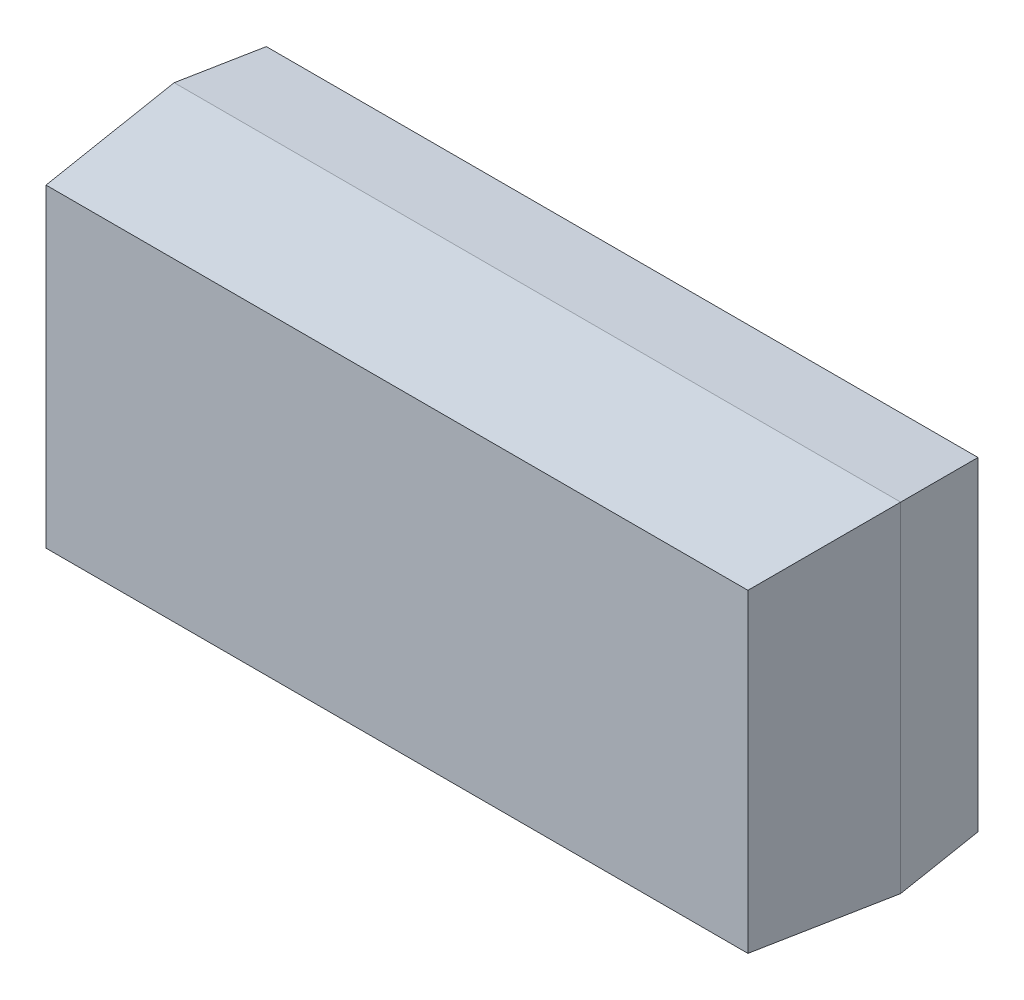
ISO-10303-21;
HEADER;
FILE_DESCRIPTION(('STEP AP214'),'2;1');
FILE_NAME('part.step','',(''),(''),'','','');
FILE_SCHEMA(('AUTOMOTIVE_DESIGN { 1 0 10303 214 1 1 1 1 }'));
ENDSEC;
DATA;
#1=APPLICATION_CONTEXT('core data for automotive mechanical design processes');
#2=APPLICATION_PROTOCOL_DEFINITION('international standard','automotive_design',2000,#1);
#3=PRODUCT_CONTEXT('',#1,'mechanical');
#4=PRODUCT('Part','Part','',(#3));
#5=PRODUCT_RELATED_PRODUCT_CATEGORY('part','',(#4));
#6=PRODUCT_DEFINITION_FORMATION('','',#4);
#7=PRODUCT_DEFINITION_CONTEXT('part definition',#1,'design');
#8=PRODUCT_DEFINITION('design','',#6,#7);
#9=PRODUCT_DEFINITION_SHAPE('','',#8);
#10=(LENGTH_UNIT() NAMED_UNIT(*) SI_UNIT(.MILLI.,.METRE.));
#11=(NAMED_UNIT(*) PLANE_ANGLE_UNIT() SI_UNIT($,.RADIAN.));
#12=(NAMED_UNIT(*) SI_UNIT($,.STERADIAN.) SOLID_ANGLE_UNIT());
#13=UNCERTAINTY_MEASURE_WITH_UNIT(LENGTH_MEASURE(1.E-05),#10,'distance_accuracy_value','');
#14=(GEOMETRIC_REPRESENTATION_CONTEXT(3) GLOBAL_UNCERTAINTY_ASSIGNED_CONTEXT((#13)) GLOBAL_UNIT_ASSIGNED_CONTEXT((#10,
#11,#12)) REPRESENTATION_CONTEXT('',''));
#15=CARTESIAN_POINT('',(0.,0.,0.));
#16=DIRECTION('',(0.,0.,1.));
#17=DIRECTION('',(1.,0.,0.));
#18=AXIS2_PLACEMENT_3D('',#15,#16,#17);
#19=CARTESIAN_POINT('',(0.769320879268443,-0.477296875218552,0.109475868077966));
#20=DIRECTION('',(0.,0.,-1.));
#21=DIRECTION('',(0.,1.,0.));
#22=AXIS2_PLACEMENT_3D('',#19,#20,#21);
#23=PLANE('',#22);
#24=DIRECTION('',(0.,1.,0.));
#25=VECTOR('',#24,1.);
#26=CARTESIAN_POINT('',(0.889141304773381,-0.418864503853573,0.109475868077966));
#27=LINE('',#26,#25);
#28=CARTESIAN_POINT('',(0.889141304773381,-0.47474074696991,0.109475868077966));
#29=VERTEX_POINT('',#28);
#30=CARTESIAN_POINT('',(0.889141304773381,-0.423618181997077,0.109475868077966));
#31=VERTEX_POINT('',#30);
#32=EDGE_CURVE('E89',#29,#31,#27,.T.);
#33=ORIENTED_EDGE('',*,*,#32,.T.);
#34=DIRECTION('',(1.,0.,0.));
#35=VECTOR('',#34,1.);
#36=CARTESIAN_POINT('',(0.767123329373579,-0.423618181997076,0.109475868077966));
#37=LINE('',#36,#35);
#38=CARTESIAN_POINT('',(0.775026613816297,-0.423618181997077,0.109475868077966));
#39=VERTEX_POINT('',#38);
#40=EDGE_CURVE('E71',#31,#39,#37,.F.);
#41=ORIENTED_EDGE('',*,*,#40,.T.);
#42=DIRECTION('',(0.,1.,0.));
#43=VECTOR('',#42,1.);
#44=CARTESIAN_POINT('',(0.775026613816297,-0.418864503853572,0.109475868077966));
#45=LINE('',#44,#43);
#46=CARTESIAN_POINT('',(0.775026613816297,-0.47474074696991,0.109475868077966));
#47=VERTEX_POINT('',#46);
#48=EDGE_CURVE('E20',#39,#47,#45,.F.);
#49=ORIENTED_EDGE('',*,*,#48,.T.);
#50=DIRECTION('',(1.,0.,0.));
#51=VECTOR('',#50,1.);
#52=CARTESIAN_POINT('',(0.767123329373579,-0.47474074696991,0.109475868077966));
#53=LINE('',#52,#51);
#54=EDGE_CURVE('E67',#47,#29,#53,.T.);
#55=ORIENTED_EDGE('',*,*,#54,.T.);
#56=EDGE_LOOP('',(#33,#41,#49,#55));
#57=FACE_BOUND('',#56,.T.);
#58=ADVANCED_FACE('F17',(#57),#23,.F.);
#59=CARTESIAN_POINT('',(0.772928952553018,-0.418864503853572,0.0854994901252098));
#60=DIRECTION('',(0.996194698091746,0.,-0.0871557427476491));
#61=DIRECTION('',(-0.0871557427476491,0.,-0.996194698091746));
#62=AXIS2_PLACEMENT_3D('',#59,#60,#61);
#63=PLANE('',#62);
#64=DIRECTION('',(0.0868265938642312,0.0868265938642406,0.992432509138969));
#65=VECTOR('',#64,1.);
#66=CARTESIAN_POINT('',(0.773028841184603,-0.476738519601604,0.0866412224086743));
#67=LINE('',#66,#65);
#68=CARTESIAN_POINT('',(0.773028841184603,-0.476738519601604,0.0866412224086743));
#69=VERTEX_POINT('',#68);
#70=EDGE_CURVE('E76',#69,#47,#67,.T.);
#71=ORIENTED_EDGE('',*,*,#70,.T.);
#72=ORIENTED_EDGE('',*,*,#48,.F.);
#73=DIRECTION('',(-0.0868265938642312,0.0868265938642006,-0.992432509138973));
#74=VECTOR('',#73,1.);
#75=CARTESIAN_POINT('',(0.775026613816297,-0.423618181997076,0.109475868077966));
#76=LINE('',#75,#74);
#77=CARTESIAN_POINT('',(0.773028841184603,-0.421620409365383,0.0866412224086743));
#78=VERTEX_POINT('',#77);
#79=EDGE_CURVE('E91',#39,#78,#76,.T.);
#80=ORIENTED_EDGE('',*,*,#79,.T.);
#81=DIRECTION('',(0.,1.,0.));
#82=VECTOR('',#81,1.);
#83=CARTESIAN_POINT('',(0.773028841184603,-0.418864503853572,0.0866412224086743));
#84=LINE('',#83,#82);
#85=EDGE_CURVE('E85',#78,#69,#84,.F.);
#86=ORIENTED_EDGE('',*,*,#85,.T.);
#87=EDGE_LOOP('',(#71,#72,#80,#86));
#88=FACE_BOUND('',#87,.T.);
#89=ADVANCED_FACE('F84',(#88),#63,.F.);
#90=CARTESIAN_POINT('',(0.767123329373579,-0.476838408233189,0.0854994901252098));
#91=DIRECTION('',(0.,0.996194698091746,-0.087155742747651));
#92=DIRECTION('',(0.,0.087155742747651,0.996194698091746));
#93=AXIS2_PLACEMENT_3D('',#90,#91,#92);
#94=PLANE('',#93);
#95=DIRECTION('',(-0.0868265938642406,0.0868265938642336,0.992432509138969));
#96=VECTOR('',#95,1.);
#97=CARTESIAN_POINT('',(0.891139077405075,-0.476738519601604,0.0866412224086743));
#98=LINE('',#97,#96);
#99=CARTESIAN_POINT('',(0.891139077405075,-0.476738519601604,0.0866412224086743));
#100=VERTEX_POINT('',#99);
#101=EDGE_CURVE('E82',#100,#29,#98,.T.);
#102=ORIENTED_EDGE('',*,*,#101,.T.);
#103=ORIENTED_EDGE('',*,*,#54,.F.);
#104=ORIENTED_EDGE('',*,*,#70,.F.);
#105=DIRECTION('',(1.,0.,0.));
#106=VECTOR('',#105,1.);
#107=CARTESIAN_POINT('',(0.767123329373579,-0.476738519601604,0.0866412224086743));
#108=LINE('',#107,#106);
#109=EDGE_CURVE('E101',#69,#100,#108,.T.);
#110=ORIENTED_EDGE('',*,*,#109,.T.);
#111=EDGE_LOOP('',(#102,#103,#104,#110));
#112=FACE_BOUND('',#111,.T.);
#113=ADVANCED_FACE('F79',(#112),#94,.F.);
#114=CARTESIAN_POINT('',(0.889041416141796,-0.418864503853573,0.11061760036143));
#115=DIRECTION('',(-0.996194698091746,0.,-0.0871557427476518));
#116=DIRECTION('',(-0.0871557427476518,0.,0.996194698091746));
#117=AXIS2_PLACEMENT_3D('',#114,#115,#116);
#118=PLANE('',#117);
#119=ORIENTED_EDGE('',*,*,#101,.F.);
#120=DIRECTION('',(0.,1.,0.));
#121=VECTOR('',#120,1.);
#122=CARTESIAN_POINT('',(0.891139077405075,-0.418864503853573,0.0866412224086743));
#123=LINE('',#122,#121);
#124=CARTESIAN_POINT('',(0.891139077405075,-0.421620409365384,0.0866412224086743));
#125=VERTEX_POINT('',#124);
#126=EDGE_CURVE('E106',#100,#125,#123,.T.);
#127=ORIENTED_EDGE('',*,*,#126,.T.);
#128=DIRECTION('',(-0.0868265938642316,-0.0868265938642009,0.992432509138973));
#129=VECTOR('',#128,1.);
#130=CARTESIAN_POINT('',(0.891139077405075,-0.421620409365383,0.0866412224086744));
#131=LINE('',#130,#129);
#132=EDGE_CURVE('E93',#125,#31,#131,.T.);
#133=ORIENTED_EDGE('',*,*,#132,.T.);
#134=ORIENTED_EDGE('',*,*,#32,.F.);
#135=EDGE_LOOP('',(#119,#127,#133,#134));
#136=FACE_BOUND('',#135,.T.);
#137=ADVANCED_FACE('F153',(#136),#118,.F.);
#138=CARTESIAN_POINT('',(0.767123329373579,-0.423718070628661,0.11061760036143));
#139=DIRECTION('',(0.,-0.99619469809175,-0.0871557427476112));
#140=DIRECTION('',(0.,0.0871557427476112,-0.99619469809175));
#141=AXIS2_PLACEMENT_3D('',#138,#139,#140);
#142=PLANE('',#141);
#143=ORIENTED_EDGE('',*,*,#132,.F.);
#144=DIRECTION('',(1.,0.,0.));
#145=VECTOR('',#144,1.);
#146=CARTESIAN_POINT('',(0.767123329373579,-0.421620409365383,0.0866412224086742));
#147=LINE('',#146,#145);
#148=EDGE_CURVE('E113',#125,#78,#147,.F.);
#149=ORIENTED_EDGE('',*,*,#148,.T.);
#150=ORIENTED_EDGE('',*,*,#79,.F.);
#151=ORIENTED_EDGE('',*,*,#40,.F.);
#152=EDGE_LOOP('',(#143,#149,#150,#151));
#153=FACE_BOUND('',#152,.T.);
#154=ADVANCED_FACE('F150',(#153),#142,.F.);
#155=CARTESIAN_POINT('',(0.774294671257271,-0.418864503853572,0.0721727184716664));
#156=DIRECTION('',(0.996194698091747,0.,0.0871557427476422));
#157=DIRECTION('',(0.0871557427476422,0.,-0.996194698091747));
#158=AXIS2_PLACEMENT_3D('',#155,#156,#157);
#159=PLANE('',#158);
#160=DIRECTION('',(-0.0868265938642169,-0.0868265938642404,0.99243250913897));
#161=VECTOR('',#160,1.);
#162=CARTESIAN_POINT('',(0.774234393634763,-0.475532967151444,0.0728616948496191));
#163=LINE('',#162,#161);
#164=CARTESIAN_POINT('',(0.774234393634763,-0.475532967151444,0.0728616948496191));
#165=VERTEX_POINT('',#164);
#166=EDGE_CURVE('E98',#165,#69,#163,.T.);
#167=ORIENTED_EDGE('',*,*,#166,.T.);
#168=ORIENTED_EDGE('',*,*,#85,.F.);
#169=DIRECTION('',(0.0868265938642165,-0.0868265938643102,-0.992432509138964));
#170=VECTOR('',#169,1.);
#171=CARTESIAN_POINT('',(0.773028841184603,-0.421620409365383,0.0866412224086743));
#172=LINE('',#171,#170);
#173=CARTESIAN_POINT('',(0.774234393634763,-0.422825961815545,0.0728616948496191));
#174=VERTEX_POINT('',#173);
#175=EDGE_CURVE('E109',#78,#174,#172,.T.);
#176=ORIENTED_EDGE('',*,*,#175,.T.);
#177=DIRECTION('',(0.,-1.,0.));
#178=VECTOR('',#177,1.);
#179=CARTESIAN_POINT('',(0.774234393634763,-0.42019061154875,0.0728616948496192));
#180=LINE('',#179,#178);
#181=EDGE_CURVE('E116',#174,#165,#180,.T.);
#182=ORIENTED_EDGE('',*,*,#181,.T.);
#183=EDGE_LOOP('',(#167,#168,#176,#182));
#184=FACE_BOUND('',#183,.T.);
#185=ADVANCED_FACE('F133',(#184),#159,.F.);
#186=CARTESIAN_POINT('',(0.767123329373579,-0.475472689528936,0.0721727184716664));
#187=DIRECTION('',(0.,0.996194698091746,0.0871557427476517));
#188=DIRECTION('',(0.,-0.0871557427476517,0.996194698091746));
#189=AXIS2_PLACEMENT_3D('',#186,#187,#188);
#190=PLANE('',#189);
#191=ORIENTED_EDGE('',*,*,#166,.F.);
#192=DIRECTION('',(1.,0.,0.));
#193=VECTOR('',#192,1.);
#194=CARTESIAN_POINT('',(0.768449437068755,-0.475532967151444,0.0728616948496192));
#195=LINE('',#194,#193);
#196=CARTESIAN_POINT('',(0.889933524954915,-0.475532967151444,0.0728616948496192));
#197=VERTEX_POINT('',#196);
#198=EDGE_CURVE('E119',#165,#197,#195,.T.);
#199=ORIENTED_EDGE('',*,*,#198,.T.);
#200=DIRECTION('',(0.0868265938642323,-0.0868265938642206,0.992432509138971));
#201=VECTOR('',#200,1.);
#202=CARTESIAN_POINT('',(0.889933524954915,-0.475532967151444,0.0728616948496191));
#203=LINE('',#202,#201);
#204=EDGE_CURVE('E103',#197,#100,#203,.T.);
#205=ORIENTED_EDGE('',*,*,#204,.T.);
#206=ORIENTED_EDGE('',*,*,#109,.F.);
#207=EDGE_LOOP('',(#191,#199,#205,#206));
#208=FACE_BOUND('',#207,.T.);
#209=ADVANCED_FACE('F131',(#208),#190,.F.);
#210=CARTESIAN_POINT('',(0.891199355027583,-0.418864503853573,0.0873301987866271));
#211=DIRECTION('',(-0.996194698091747,0.,0.0871557427476418));
#212=DIRECTION('',(0.0871557427476418,0.,0.996194698091747));
#213=AXIS2_PLACEMENT_3D('',#210,#211,#212);
#214=PLANE('',#213);
#215=ORIENTED_EDGE('',*,*,#204,.F.);
#216=DIRECTION('',(0.,-1.,0.));
#217=VECTOR('',#216,1.);
#218=CARTESIAN_POINT('',(0.889933524954915,-0.42019061154875,0.0728616948496192));
#219=LINE('',#218,#217);
#220=CARTESIAN_POINT('',(0.889933524954915,-0.422825961815545,0.0728616948496192));
#221=VERTEX_POINT('',#220);
#222=EDGE_CURVE('E26',#197,#221,#219,.F.);
#223=ORIENTED_EDGE('',*,*,#222,.T.);
#224=DIRECTION('',(0.0868265938642246,0.0868265938643105,0.992432509138964));
#225=VECTOR('',#224,1.);
#226=CARTESIAN_POINT('',(0.889933524954915,-0.422825961815544,0.0728616948496191));
#227=LINE('',#226,#225);
#228=EDGE_CURVE('E34',#221,#125,#227,.T.);
#229=ORIENTED_EDGE('',*,*,#228,.T.);
#230=ORIENTED_EDGE('',*,*,#126,.F.);
#231=EDGE_LOOP('',(#215,#223,#229,#230));
#232=FACE_BOUND('',#231,.T.);
#233=ADVANCED_FACE('F125',(#232),#214,.F.);
#234=CARTESIAN_POINT('',(0.767123329373579,-0.421560131742875,0.0873301987866271));
#235=DIRECTION('',(0.,-0.99619469809174,0.0871557427477216));
#236=DIRECTION('',(0.,-0.0871557427477216,-0.99619469809174));
#237=AXIS2_PLACEMENT_3D('',#234,#235,#236);
#238=PLANE('',#237);
#239=ORIENTED_EDGE('',*,*,#228,.F.);
#240=DIRECTION('',(1.,0.,0.));
#241=VECTOR('',#240,1.);
#242=CARTESIAN_POINT('',(0.768449437068755,-0.422825961815545,0.0728616948496192));
#243=LINE('',#242,#241);
#244=EDGE_CURVE('E11',#221,#174,#243,.F.);
#245=ORIENTED_EDGE('',*,*,#244,.T.);
#246=ORIENTED_EDGE('',*,*,#175,.F.);
#247=ORIENTED_EDGE('',*,*,#148,.F.);
#248=EDGE_LOOP('',(#239,#245,#246,#247));
#249=FACE_BOUND('',#248,.T.);
#250=ADVANCED_FACE('F135',(#249),#238,.F.);
#251=CARTESIAN_POINT('',(0.768449437068755,-0.42019061154875,0.0728616948496192));
#252=DIRECTION('',(0.,0.,1.));
#253=DIRECTION('',(0.,-1.,0.));
#254=AXIS2_PLACEMENT_3D('',#251,#252,#253);
#255=PLANE('',#254);
#256=ORIENTED_EDGE('',*,*,#222,.F.);
#257=ORIENTED_EDGE('',*,*,#198,.F.);
#258=ORIENTED_EDGE('',*,*,#181,.F.);
#259=ORIENTED_EDGE('',*,*,#244,.F.);
#260=EDGE_LOOP('',(#256,#257,#258,#259));
#261=FACE_BOUND('',#260,.T.);
#262=ADVANCED_FACE('F129',(#261),#255,.F.);
#263=CLOSED_SHELL('',(#58,#89,#113,#137,#154,#185,#209,#233,#250,#262));
#264=MANIFOLD_SOLID_BREP('B1',#263);
#265=ADVANCED_BREP_SHAPE_REPRESENTATION('',(#18,#264),#14);
#266=SHAPE_DEFINITION_REPRESENTATION(#9,#265);
ENDSEC;
END-ISO-10303-21;
